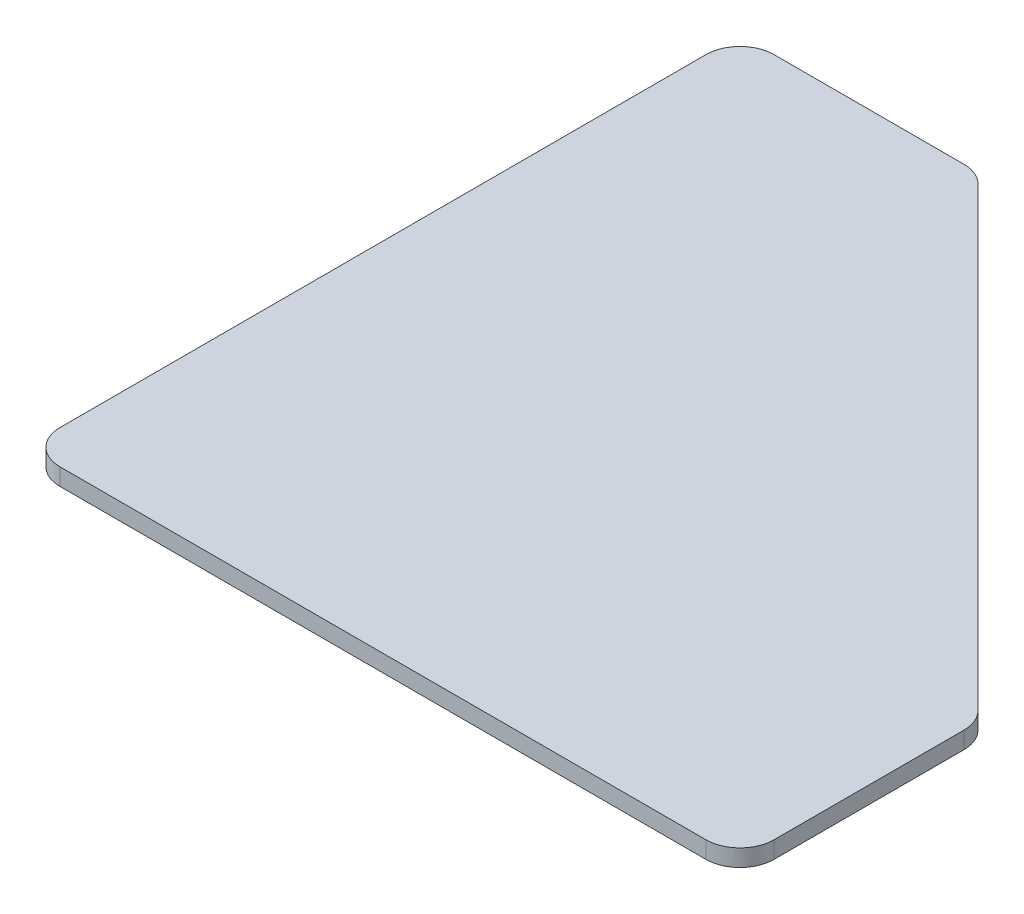
ISO-10303-21;
HEADER;
FILE_DESCRIPTION(('STEP AP214'),'2;1');
FILE_NAME('part.step','',(''),(''),'','','');
FILE_SCHEMA(('AUTOMOTIVE_DESIGN { 1 0 10303 214 1 1 1 1 }'));
ENDSEC;
DATA;
#1=APPLICATION_CONTEXT('core data for automotive mechanical design processes');
#2=APPLICATION_PROTOCOL_DEFINITION('international standard','automotive_design',2000,#1);
#3=PRODUCT_CONTEXT('',#1,'mechanical');
#4=PRODUCT('Part','Part','',(#3));
#5=PRODUCT_RELATED_PRODUCT_CATEGORY('part','',(#4));
#6=PRODUCT_DEFINITION_FORMATION('','',#4);
#7=PRODUCT_DEFINITION_CONTEXT('part definition',#1,'design');
#8=PRODUCT_DEFINITION('design','',#6,#7);
#9=PRODUCT_DEFINITION_SHAPE('','',#8);
#10=(LENGTH_UNIT() NAMED_UNIT(*) SI_UNIT(.MILLI.,.METRE.));
#11=(NAMED_UNIT(*) PLANE_ANGLE_UNIT() SI_UNIT($,.RADIAN.));
#12=(NAMED_UNIT(*) SI_UNIT($,.STERADIAN.) SOLID_ANGLE_UNIT());
#13=UNCERTAINTY_MEASURE_WITH_UNIT(LENGTH_MEASURE(1.E-05),#10,'distance_accuracy_value','');
#14=(GEOMETRIC_REPRESENTATION_CONTEXT(3) GLOBAL_UNCERTAINTY_ASSIGNED_CONTEXT((#13)) GLOBAL_UNIT_ASSIGNED_CONTEXT((#10,
#11,#12)) REPRESENTATION_CONTEXT('',''));
#15=CARTESIAN_POINT('',(0.,0.,0.));
#16=DIRECTION('',(0.,0.,1.));
#17=DIRECTION('',(1.,0.,0.));
#18=AXIS2_PLACEMENT_3D('',#15,#16,#17);
#19=CARTESIAN_POINT('',(133.35,3.175,0.));
#20=DIRECTION('',(0.,0.,-1.));
#21=DIRECTION('',(-1.,0.,0.));
#22=AXIS2_PLACEMENT_3D('',#19,#20,#21);
#23=PLANE('',#22);
#24=DIRECTION('',(1.,0.,0.));
#25=VECTOR('',#24,1.);
#26=CARTESIAN_POINT('',(133.35,0.,0.));
#27=LINE('',#26,#25);
#28=CARTESIAN_POINT('',(6.34999999999999,0.,0.));
#29=VERTEX_POINT('',#28);
#30=CARTESIAN_POINT('',(127.,0.,0.));
#31=VERTEX_POINT('',#30);
#32=EDGE_CURVE('E183',#29,#31,#27,.T.);
#33=ORIENTED_EDGE('',*,*,#32,.T.);
#34=DIRECTION('',(0.,-1.,0.));
#35=VECTOR('',#34,1.);
#36=CARTESIAN_POINT('',(127.,3.175,0.));
#37=LINE('',#36,#35);
#38=CARTESIAN_POINT('',(127.,3.175,0.));
#39=VERTEX_POINT('',#38);
#40=EDGE_CURVE('E11',#31,#39,#37,.F.);
#41=ORIENTED_EDGE('',*,*,#40,.T.);
#42=DIRECTION('',(1.,0.,0.));
#43=VECTOR('',#42,1.);
#44=CARTESIAN_POINT('',(133.35,3.175,0.));
#45=LINE('',#44,#43);
#46=CARTESIAN_POINT('',(6.34999999999999,3.175,0.));
#47=VERTEX_POINT('',#46);
#48=EDGE_CURVE('E141',#47,#39,#45,.T.);
#49=ORIENTED_EDGE('',*,*,#48,.F.);
#50=DIRECTION('',(0.,-1.,0.));
#51=VECTOR('',#50,1.);
#52=CARTESIAN_POINT('',(6.34999999999999,3.175,0.));
#53=LINE('',#52,#51);
#54=EDGE_CURVE('E45',#47,#29,#53,.T.);
#55=ORIENTED_EDGE('',*,*,#54,.T.);
#56=EDGE_LOOP('',(#33,#41,#49,#55));
#57=FACE_BOUND('',#56,.T.);
#58=ADVANCED_FACE('F37',(#57),#23,.F.);
#59=CARTESIAN_POINT('',(133.35,3.175,-44.45));
#60=DIRECTION('',(-1.,0.,0.));
#61=DIRECTION('',(0.,0.,1.));
#62=AXIS2_PLACEMENT_3D('',#59,#60,#61);
#63=PLANE('',#62);
#64=DIRECTION('',(0.,0.,-1.));
#65=VECTOR('',#64,1.);
#66=CARTESIAN_POINT('',(133.35,0.,-44.45));
#67=LINE('',#66,#65);
#68=CARTESIAN_POINT('',(133.35,0.,-6.35));
#69=VERTEX_POINT('',#68);
#70=CARTESIAN_POINT('',(133.35,0.,-41.8197438789308));
#71=VERTEX_POINT('',#70);
#72=EDGE_CURVE('E188',#69,#71,#67,.T.);
#73=ORIENTED_EDGE('',*,*,#72,.T.);
#74=DIRECTION('',(0.,-1.,0.));
#75=VECTOR('',#74,1.);
#76=CARTESIAN_POINT('',(133.35,3.175,-41.8197438789308));
#77=LINE('',#76,#75);
#78=CARTESIAN_POINT('',(133.35,3.175,-41.8197438789308));
#79=VERTEX_POINT('',#78);
#80=EDGE_CURVE('E177',#71,#79,#77,.F.);
#81=ORIENTED_EDGE('',*,*,#80,.T.);
#82=DIRECTION('',(0.,0.,-1.));
#83=VECTOR('',#82,1.);
#84=CARTESIAN_POINT('',(133.35,3.175,-44.45));
#85=LINE('',#84,#83);
#86=CARTESIAN_POINT('',(133.35,3.175,-6.35));
#87=VERTEX_POINT('',#86);
#88=EDGE_CURVE('E145',#87,#79,#85,.T.);
#89=ORIENTED_EDGE('',*,*,#88,.F.);
#90=DIRECTION('',(0.,-1.,0.));
#91=VECTOR('',#90,1.);
#92=CARTESIAN_POINT('',(133.35,3.175,-6.35));
#93=LINE('',#92,#91);
#94=EDGE_CURVE('E174',#87,#69,#93,.T.);
#95=ORIENTED_EDGE('',*,*,#94,.T.);
#96=EDGE_LOOP('',(#73,#81,#89,#95));
#97=FACE_BOUND('',#96,.T.);
#98=ADVANCED_FACE('F217',(#97),#63,.F.);
#99=CARTESIAN_POINT('',(44.45,3.175,-133.35));
#100=DIRECTION('',(-0.707106781186548,0.,0.707106781186548));
#101=DIRECTION('',(0.707106781186548,0.,0.707106781186548));
#102=AXIS2_PLACEMENT_3D('',#99,#100,#101);
#103=PLANE('',#102);
#104=DIRECTION('',(-0.707106781186548,0.,-0.707106781186548));
#105=VECTOR('',#104,1.);
#106=CARTESIAN_POINT('',(44.45,0.,-133.35));
#107=LINE('',#106,#105);
#108=CARTESIAN_POINT('',(131.490128060535,0.,-46.3098719394654));
#109=VERTEX_POINT('',#108);
#110=CARTESIAN_POINT('',(46.3098719394654,0.,-131.490128060535));
#111=VERTEX_POINT('',#110);
#112=EDGE_CURVE('E147',#109,#111,#107,.T.);
#113=ORIENTED_EDGE('',*,*,#112,.T.);
#114=DIRECTION('',(0.,-1.,0.));
#115=VECTOR('',#114,1.);
#116=CARTESIAN_POINT('',(46.3098719394654,3.175,-131.490128060535));
#117=LINE('',#116,#115);
#118=CARTESIAN_POINT('',(46.3098719394654,3.175,-131.490128060535));
#119=VERTEX_POINT('',#118);
#120=EDGE_CURVE('E52',#111,#119,#117,.F.);
#121=ORIENTED_EDGE('',*,*,#120,.T.);
#122=DIRECTION('',(-0.707106781186548,0.,-0.707106781186548));
#123=VECTOR('',#122,1.);
#124=CARTESIAN_POINT('',(44.45,3.175,-133.35));
#125=LINE('',#124,#123);
#126=CARTESIAN_POINT('',(131.490128060535,3.175,-46.3098719394654));
#127=VERTEX_POINT('',#126);
#128=EDGE_CURVE('E205',#127,#119,#125,.T.);
#129=ORIENTED_EDGE('',*,*,#128,.F.);
#130=DIRECTION('',(0.,-1.,0.));
#131=VECTOR('',#130,1.);
#132=CARTESIAN_POINT('',(131.490128060535,3.175,-46.3098719394654));
#133=LINE('',#132,#131);
#134=EDGE_CURVE('E170',#127,#109,#133,.T.);
#135=ORIENTED_EDGE('',*,*,#134,.T.);
#136=EDGE_LOOP('',(#113,#121,#129,#135));
#137=FACE_BOUND('',#136,.T.);
#138=ADVANCED_FACE('F195',(#137),#103,.F.);
#139=CARTESIAN_POINT('',(0.,3.175,-133.35));
#140=DIRECTION('',(0.,0.,1.));
#141=DIRECTION('',(1.,0.,0.));
#142=AXIS2_PLACEMENT_3D('',#139,#140,#141);
#143=PLANE('',#142);
#144=DIRECTION('',(-1.,0.,0.));
#145=VECTOR('',#144,1.);
#146=CARTESIAN_POINT('',(0.,0.,-133.35));
#147=LINE('',#146,#145);
#148=CARTESIAN_POINT('',(41.8197438789308,0.,-133.35));
#149=VERTEX_POINT('',#148);
#150=CARTESIAN_POINT('',(6.35,0.,-133.35));
#151=VERTEX_POINT('',#150);
#152=EDGE_CURVE('E142',#149,#151,#147,.T.);
#153=ORIENTED_EDGE('',*,*,#152,.T.);
#154=DIRECTION('',(0.,-1.,0.));
#155=VECTOR('',#154,1.);
#156=CARTESIAN_POINT('',(6.35,3.175,-133.35));
#157=LINE('',#156,#155);
#158=CARTESIAN_POINT('',(6.35,3.175,-133.35));
#159=VERTEX_POINT('',#158);
#160=EDGE_CURVE('E120',#151,#159,#157,.F.);
#161=ORIENTED_EDGE('',*,*,#160,.T.);
#162=DIRECTION('',(-1.,0.,0.));
#163=VECTOR('',#162,1.);
#164=CARTESIAN_POINT('',(0.,3.175,-133.35));
#165=LINE('',#164,#163);
#166=CARTESIAN_POINT('',(41.8197438789308,3.175,-133.35));
#167=VERTEX_POINT('',#166);
#168=EDGE_CURVE('E204',#167,#159,#165,.T.);
#169=ORIENTED_EDGE('',*,*,#168,.F.);
#170=DIRECTION('',(0.,-1.,0.));
#171=VECTOR('',#170,1.);
#172=CARTESIAN_POINT('',(41.8197438789308,3.175,-133.35));
#173=LINE('',#172,#171);
#174=EDGE_CURVE('E125',#167,#149,#173,.T.);
#175=ORIENTED_EDGE('',*,*,#174,.T.);
#176=EDGE_LOOP('',(#153,#161,#169,#175));
#177=FACE_BOUND('',#176,.T.);
#178=ADVANCED_FACE('F207',(#177),#143,.F.);
#179=CARTESIAN_POINT('',(0.,3.175,0.));
#180=DIRECTION('',(1.,0.,0.));
#181=DIRECTION('',(0.,0.,-1.));
#182=AXIS2_PLACEMENT_3D('',#179,#180,#181);
#183=PLANE('',#182);
#184=DIRECTION('',(0.,0.,1.));
#185=VECTOR('',#184,1.);
#186=CARTESIAN_POINT('',(0.,3.175,0.));
#187=LINE('',#186,#185);
#188=CARTESIAN_POINT('',(0.,3.175,-127.));
#189=VERTEX_POINT('',#188);
#190=CARTESIAN_POINT('',(0.,3.175,-6.35));
#191=VERTEX_POINT('',#190);
#192=EDGE_CURVE('E135',#189,#191,#187,.T.);
#193=ORIENTED_EDGE('',*,*,#192,.F.);
#194=DIRECTION('',(0.,-1.,0.));
#195=VECTOR('',#194,1.);
#196=CARTESIAN_POINT('',(0.,3.175,-127.));
#197=LINE('',#196,#195);
#198=CARTESIAN_POINT('',(0.,0.,-127.));
#199=VERTEX_POINT('',#198);
#200=EDGE_CURVE('E119',#189,#199,#197,.T.);
#201=ORIENTED_EDGE('',*,*,#200,.T.);
#202=DIRECTION('',(0.,0.,1.));
#203=VECTOR('',#202,1.);
#204=CARTESIAN_POINT('',(0.,0.,0.));
#205=LINE('',#204,#203);
#206=CARTESIAN_POINT('',(0.,0.,-6.35));
#207=VERTEX_POINT('',#206);
#208=EDGE_CURVE('E132',#199,#207,#205,.T.);
#209=ORIENTED_EDGE('',*,*,#208,.T.);
#210=DIRECTION('',(0.,-1.,0.));
#211=VECTOR('',#210,1.);
#212=CARTESIAN_POINT('',(0.,3.175,-6.35));
#213=LINE('',#212,#211);
#214=EDGE_CURVE('E137',#207,#191,#213,.F.);
#215=ORIENTED_EDGE('',*,*,#214,.T.);
#216=EDGE_LOOP('',(#193,#201,#209,#215));
#217=FACE_BOUND('',#216,.T.);
#218=ADVANCED_FACE('F131',(#217),#183,.F.);
#219=CARTESIAN_POINT('',(0.,3.175,0.));
#220=DIRECTION('',(0.,-1.,0.));
#221=DIRECTION('',(0.,0.,-1.));
#222=AXIS2_PLACEMENT_3D('',#219,#220,#221);
#223=PLANE('',#222);
#224=ORIENTED_EDGE('',*,*,#168,.T.);
#225=CARTESIAN_POINT('',(6.35,3.175,-127.));
#226=DIRECTION('',(0.,-1.,0.));
#227=DIRECTION('',(0.,0.,-1.));
#228=AXIS2_PLACEMENT_3D('',#225,#226,#227);
#229=CIRCLE('',#228,6.35);
#230=EDGE_CURVE('E168',#159,#189,#229,.F.);
#231=ORIENTED_EDGE('',*,*,#230,.T.);
#232=ORIENTED_EDGE('',*,*,#192,.T.);
#233=CARTESIAN_POINT('',(6.34999999999999,3.175,-6.35));
#234=DIRECTION('',(0.,-1.,0.));
#235=DIRECTION('',(0.,0.,-1.));
#236=AXIS2_PLACEMENT_3D('',#233,#234,#235);
#237=CIRCLE('',#236,6.35);
#238=EDGE_CURVE('E161',#191,#47,#237,.F.);
#239=ORIENTED_EDGE('',*,*,#238,.T.);
#240=ORIENTED_EDGE('',*,*,#48,.T.);
#241=CARTESIAN_POINT('',(127.,3.175,-6.35));
#242=DIRECTION('',(0.,-1.,0.));
#243=DIRECTION('',(0.,0.,-1.));
#244=AXIS2_PLACEMENT_3D('',#241,#242,#243);
#245=CIRCLE('',#244,6.35);
#246=EDGE_CURVE('E163',#39,#87,#245,.F.);
#247=ORIENTED_EDGE('',*,*,#246,.T.);
#248=ORIENTED_EDGE('',*,*,#88,.T.);
#249=CARTESIAN_POINT('',(127.,3.175,-41.8197438789308));
#250=DIRECTION('',(0.,-1.,0.));
#251=DIRECTION('',(0.,0.,-1.));
#252=AXIS2_PLACEMENT_3D('',#249,#250,#251);
#253=CIRCLE('',#252,6.35);
#254=EDGE_CURVE('E59',#79,#127,#253,.F.);
#255=ORIENTED_EDGE('',*,*,#254,.T.);
#256=ORIENTED_EDGE('',*,*,#128,.T.);
#257=CARTESIAN_POINT('',(41.8197438789308,3.175,-127.));
#258=DIRECTION('',(0.,-1.,0.));
#259=DIRECTION('',(0.,0.,-1.));
#260=AXIS2_PLACEMENT_3D('',#257,#258,#259);
#261=CIRCLE('',#260,6.35);
#262=EDGE_CURVE('E166',#119,#167,#261,.F.);
#263=ORIENTED_EDGE('',*,*,#262,.T.);
#264=EDGE_LOOP('',(#224,#231,#232,#239,#240,#247,#248,#255,#256,#263));
#265=FACE_BOUND('',#264,.T.);
#266=ADVANCED_FACE('F203',(#265),#223,.F.);
#267=CARTESIAN_POINT('',(0.,0.,0.));
#268=DIRECTION('',(0.,-1.,0.));
#269=DIRECTION('',(0.,0.,-1.));
#270=AXIS2_PLACEMENT_3D('',#267,#268,#269);
#271=PLANE('',#270);
#272=ORIENTED_EDGE('',*,*,#208,.F.);
#273=CARTESIAN_POINT('',(6.35,0.,-127.));
#274=DIRECTION('',(0.,-1.,0.));
#275=DIRECTION('',(0.,0.,-1.));
#276=AXIS2_PLACEMENT_3D('',#273,#274,#275);
#277=CIRCLE('',#276,6.35);
#278=EDGE_CURVE('E115',#199,#151,#277,.T.);
#279=ORIENTED_EDGE('',*,*,#278,.T.);
#280=ORIENTED_EDGE('',*,*,#152,.F.);
#281=CARTESIAN_POINT('',(41.8197438789308,0.,-127.));
#282=DIRECTION('',(0.,-1.,0.));
#283=DIRECTION('',(0.,0.,-1.));
#284=AXIS2_PLACEMENT_3D('',#281,#282,#283);
#285=CIRCLE('',#284,6.35);
#286=EDGE_CURVE('E126',#149,#111,#285,.T.);
#287=ORIENTED_EDGE('',*,*,#286,.T.);
#288=ORIENTED_EDGE('',*,*,#112,.F.);
#289=CARTESIAN_POINT('',(127.,0.,-41.8197438789308));
#290=DIRECTION('',(0.,-1.,0.));
#291=DIRECTION('',(0.,0.,-1.));
#292=AXIS2_PLACEMENT_3D('',#289,#290,#291);
#293=CIRCLE('',#292,6.35);
#294=EDGE_CURVE('E155',#109,#71,#293,.T.);
#295=ORIENTED_EDGE('',*,*,#294,.T.);
#296=ORIENTED_EDGE('',*,*,#72,.F.);
#297=CARTESIAN_POINT('',(127.,0.,-6.35));
#298=DIRECTION('',(0.,-1.,0.));
#299=DIRECTION('',(0.,0.,-1.));
#300=AXIS2_PLACEMENT_3D('',#297,#298,#299);
#301=CIRCLE('',#300,6.35);
#302=EDGE_CURVE('E153',#69,#31,#301,.T.);
#303=ORIENTED_EDGE('',*,*,#302,.T.);
#304=ORIENTED_EDGE('',*,*,#32,.F.);
#305=CARTESIAN_POINT('',(6.34999999999999,0.,-6.35));
#306=DIRECTION('',(0.,-1.,0.));
#307=DIRECTION('',(0.,0.,-1.));
#308=AXIS2_PLACEMENT_3D('',#305,#306,#307);
#309=CIRCLE('',#308,6.35);
#310=EDGE_CURVE('E136',#29,#207,#309,.T.);
#311=ORIENTED_EDGE('',*,*,#310,.T.);
#312=EDGE_LOOP('',(#272,#279,#280,#287,#288,#295,#296,#303,#304,#311));
#313=FACE_BOUND('',#312,.T.);
#314=ADVANCED_FACE('F139',(#313),#271,.T.);
#315=CARTESIAN_POINT('',(6.35,3.175,-127.));
#316=DIRECTION('',(0.,-1.,0.));
#317=DIRECTION('',(0.,0.,-1.));
#318=AXIS2_PLACEMENT_3D('',#315,#316,#317);
#319=CYLINDRICAL_SURFACE('',#318,6.35);
#320=ORIENTED_EDGE('',*,*,#230,.F.);
#321=ORIENTED_EDGE('',*,*,#160,.F.);
#322=ORIENTED_EDGE('',*,*,#278,.F.);
#323=ORIENTED_EDGE('',*,*,#200,.F.);
#324=EDGE_LOOP('',(#320,#321,#322,#323));
#325=FACE_BOUND('',#324,.T.);
#326=ADVANCED_FACE('F118',(#325),#319,.T.);
#327=CARTESIAN_POINT('',(41.8197438789308,3.175,-127.));
#328=DIRECTION('',(0.,-1.,0.));
#329=DIRECTION('',(0.,0.,-1.));
#330=AXIS2_PLACEMENT_3D('',#327,#328,#329);
#331=CYLINDRICAL_SURFACE('',#330,6.35);
#332=ORIENTED_EDGE('',*,*,#262,.F.);
#333=ORIENTED_EDGE('',*,*,#120,.F.);
#334=ORIENTED_EDGE('',*,*,#286,.F.);
#335=ORIENTED_EDGE('',*,*,#174,.F.);
#336=EDGE_LOOP('',(#332,#333,#334,#335));
#337=FACE_BOUND('',#336,.T.);
#338=ADVANCED_FACE('F199',(#337),#331,.T.);
#339=CARTESIAN_POINT('',(127.,3.175,-41.8197438789308));
#340=DIRECTION('',(0.,-1.,0.));
#341=DIRECTION('',(0.,0.,-1.));
#342=AXIS2_PLACEMENT_3D('',#339,#340,#341);
#343=CYLINDRICAL_SURFACE('',#342,6.35);
#344=ORIENTED_EDGE('',*,*,#254,.F.);
#345=ORIENTED_EDGE('',*,*,#80,.F.);
#346=ORIENTED_EDGE('',*,*,#294,.F.);
#347=ORIENTED_EDGE('',*,*,#134,.F.);
#348=EDGE_LOOP('',(#344,#345,#346,#347));
#349=FACE_BOUND('',#348,.T.);
#350=ADVANCED_FACE('F216',(#349),#343,.T.);
#351=CARTESIAN_POINT('',(127.,3.175,-6.35));
#352=DIRECTION('',(0.,-1.,0.));
#353=DIRECTION('',(0.,0.,-1.));
#354=AXIS2_PLACEMENT_3D('',#351,#352,#353);
#355=CYLINDRICAL_SURFACE('',#354,6.35);
#356=ORIENTED_EDGE('',*,*,#246,.F.);
#357=ORIENTED_EDGE('',*,*,#40,.F.);
#358=ORIENTED_EDGE('',*,*,#302,.F.);
#359=ORIENTED_EDGE('',*,*,#94,.F.);
#360=EDGE_LOOP('',(#356,#357,#358,#359));
#361=FACE_BOUND('',#360,.T.);
#362=ADVANCED_FACE('F219',(#361),#355,.T.);
#363=CARTESIAN_POINT('',(6.34999999999999,3.175,-6.35));
#364=DIRECTION('',(0.,-1.,0.));
#365=DIRECTION('',(0.,0.,-1.));
#366=AXIS2_PLACEMENT_3D('',#363,#364,#365);
#367=CYLINDRICAL_SURFACE('',#366,6.35);
#368=ORIENTED_EDGE('',*,*,#238,.F.);
#369=ORIENTED_EDGE('',*,*,#214,.F.);
#370=ORIENTED_EDGE('',*,*,#310,.F.);
#371=ORIENTED_EDGE('',*,*,#54,.F.);
#372=EDGE_LOOP('',(#368,#369,#370,#371));
#373=FACE_BOUND('',#372,.T.);
#374=ADVANCED_FACE('F39',(#373),#367,.T.);
#375=CLOSED_SHELL('',(#58,#98,#138,#178,#218,#266,#314,#326,#338,#350,#362,#374));
#376=MANIFOLD_SOLID_BREP('B2',#375);
#377=ADVANCED_BREP_SHAPE_REPRESENTATION('',(#18,#376),#14);
#378=SHAPE_DEFINITION_REPRESENTATION(#9,#377);
ENDSEC;
END-ISO-10303-21;
